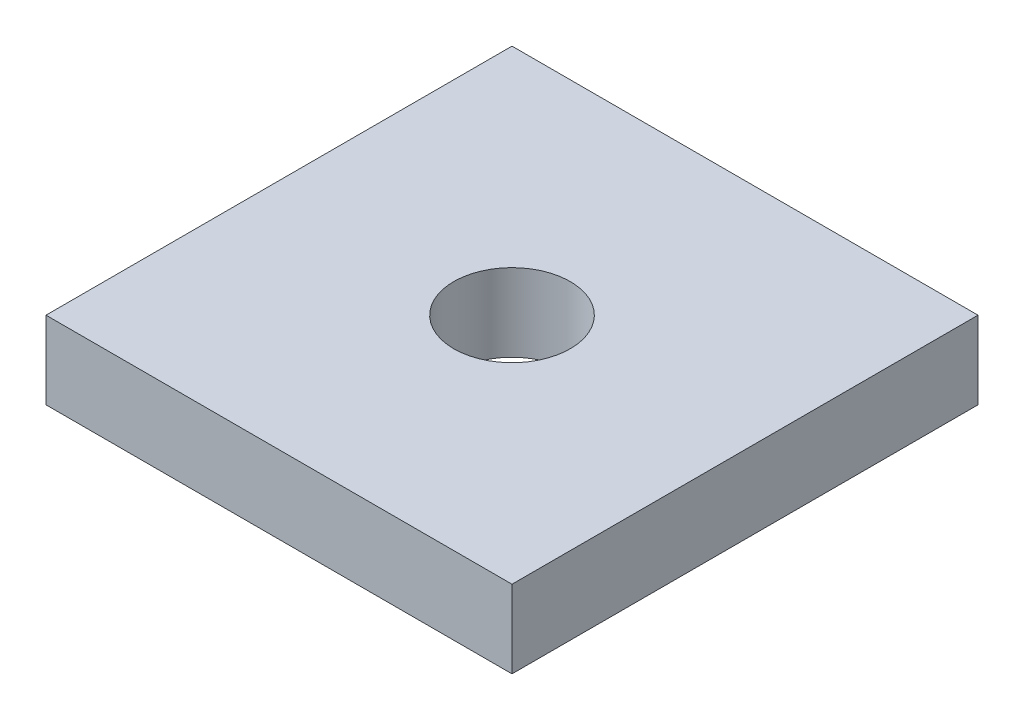
ISO-10303-21;
HEADER;
FILE_DESCRIPTION(('STEP AP214'),'2;1');
FILE_NAME('part.step','',(''),(''),'','','');
FILE_SCHEMA(('AUTOMOTIVE_DESIGN { 1 0 10303 214 1 1 1 1 }'));
ENDSEC;
DATA;
#1=APPLICATION_CONTEXT('core data for automotive mechanical design processes');
#2=APPLICATION_PROTOCOL_DEFINITION('international standard','automotive_design',2000,#1);
#3=PRODUCT_CONTEXT('',#1,'mechanical');
#4=PRODUCT('Part','Part','',(#3));
#5=PRODUCT_RELATED_PRODUCT_CATEGORY('part','',(#4));
#6=PRODUCT_DEFINITION_FORMATION('','',#4);
#7=PRODUCT_DEFINITION_CONTEXT('part definition',#1,'design');
#8=PRODUCT_DEFINITION('design','',#6,#7);
#9=PRODUCT_DEFINITION_SHAPE('','',#8);
#10=(LENGTH_UNIT() NAMED_UNIT(*) SI_UNIT(.MILLI.,.METRE.));
#11=(NAMED_UNIT(*) PLANE_ANGLE_UNIT() SI_UNIT($,.RADIAN.));
#12=(NAMED_UNIT(*) SI_UNIT($,.STERADIAN.) SOLID_ANGLE_UNIT());
#13=UNCERTAINTY_MEASURE_WITH_UNIT(LENGTH_MEASURE(1.E-05),#10,'distance_accuracy_value','');
#14=(GEOMETRIC_REPRESENTATION_CONTEXT(3) GLOBAL_UNCERTAINTY_ASSIGNED_CONTEXT((#13)) GLOBAL_UNIT_ASSIGNED_CONTEXT((#10,
#11,#12)) REPRESENTATION_CONTEXT('',''));
#15=CARTESIAN_POINT('',(0.,0.,0.));
#16=DIRECTION('',(0.,0.,1.));
#17=DIRECTION('',(1.,0.,0.));
#18=AXIS2_PLACEMENT_3D('',#15,#16,#17);
#19=CARTESIAN_POINT('',(0.,12.7,-76.2));
#20=DIRECTION('',(0.,-1.,0.));
#21=DIRECTION('',(0.,0.,-1.));
#22=AXIS2_PLACEMENT_3D('',#19,#20,#21);
#23=PLANE('',#22);
#24=DIRECTION('',(0.,0.,1.));
#25=VECTOR('',#24,1.);
#26=CARTESIAN_POINT('',(0.,12.7,0.));
#27=LINE('',#26,#25);
#28=CARTESIAN_POINT('',(0.,12.7,-76.2));
#29=VERTEX_POINT('',#28);
#30=CARTESIAN_POINT('',(0.,12.7,0.));
#31=VERTEX_POINT('',#30);
#32=EDGE_CURVE('E86',#29,#31,#27,.T.);
#33=ORIENTED_EDGE('',*,*,#32,.T.);
#34=DIRECTION('',(1.,0.,0.));
#35=VECTOR('',#34,1.);
#36=CARTESIAN_POINT('',(0.,12.7,0.));
#37=LINE('',#36,#35);
#38=CARTESIAN_POINT('',(76.2,12.7,0.));
#39=VERTEX_POINT('',#38);
#40=EDGE_CURVE('E81',#31,#39,#37,.T.);
#41=ORIENTED_EDGE('',*,*,#40,.T.);
#42=DIRECTION('',(0.,0.,-1.));
#43=VECTOR('',#42,1.);
#44=CARTESIAN_POINT('',(76.2,12.7,0.));
#45=LINE('',#44,#43);
#46=CARTESIAN_POINT('',(76.2,12.7,-76.2));
#47=VERTEX_POINT('',#46);
#48=EDGE_CURVE('E84',#39,#47,#45,.T.);
#49=ORIENTED_EDGE('',*,*,#48,.T.);
#50=DIRECTION('',(-1.,0.,0.));
#51=VECTOR('',#50,1.);
#52=CARTESIAN_POINT('',(0.,12.7,-76.2));
#53=LINE('',#52,#51);
#54=EDGE_CURVE('E51',#47,#29,#53,.T.);
#55=ORIENTED_EDGE('',*,*,#54,.T.);
#56=EDGE_LOOP('',(#33,#41,#49,#55));
#57=FACE_BOUND('',#56,.T.);
#58=CARTESIAN_POINT('',(38.1,12.7,-38.1));
#59=DIRECTION('',(0.,1.,0.));
#60=DIRECTION('',(0.,0.,1.));
#61=AXIS2_PLACEMENT_3D('',#58,#59,#60);
#62=CIRCLE('',#61,9.525);
#63=CARTESIAN_POINT('',(38.1,12.7,-28.575));
#64=VERTEX_POINT('',#63);
#65=EDGE_CURVE('E101',#64,#64,#62,.T.);
#66=ORIENTED_EDGE('',*,*,#65,.F.);
#67=EDGE_LOOP('',(#66));
#68=FACE_BOUND('',#67,.T.);
#69=ADVANCED_FACE('F34',(#57,#68),#23,.F.);
#70=CARTESIAN_POINT('',(0.,0.,-76.2));
#71=DIRECTION('',(0.,-1.,0.));
#72=DIRECTION('',(0.,0.,-1.));
#73=AXIS2_PLACEMENT_3D('',#70,#71,#72);
#74=PLANE('',#73);
#75=DIRECTION('',(0.,0.,1.));
#76=VECTOR('',#75,1.);
#77=CARTESIAN_POINT('',(0.,0.,0.));
#78=LINE('',#77,#76);
#79=CARTESIAN_POINT('',(0.,0.,-76.2));
#80=VERTEX_POINT('',#79);
#81=CARTESIAN_POINT('',(0.,0.,0.));
#82=VERTEX_POINT('',#81);
#83=EDGE_CURVE('E98',#80,#82,#78,.T.);
#84=ORIENTED_EDGE('',*,*,#83,.F.);
#85=DIRECTION('',(-1.,0.,0.));
#86=VECTOR('',#85,1.);
#87=CARTESIAN_POINT('',(0.,0.,-76.2));
#88=LINE('',#87,#86);
#89=CARTESIAN_POINT('',(76.2,0.,-76.2));
#90=VERTEX_POINT('',#89);
#91=EDGE_CURVE('E74',#90,#80,#88,.T.);
#92=ORIENTED_EDGE('',*,*,#91,.F.);
#93=DIRECTION('',(0.,0.,-1.));
#94=VECTOR('',#93,1.);
#95=CARTESIAN_POINT('',(76.2,0.,0.));
#96=LINE('',#95,#94);
#97=CARTESIAN_POINT('',(76.2,0.,0.));
#98=VERTEX_POINT('',#97);
#99=EDGE_CURVE('E68',#98,#90,#96,.T.);
#100=ORIENTED_EDGE('',*,*,#99,.F.);
#101=DIRECTION('',(1.,0.,0.));
#102=VECTOR('',#101,1.);
#103=CARTESIAN_POINT('',(0.,0.,0.));
#104=LINE('',#103,#102);
#105=EDGE_CURVE('E90',#82,#98,#104,.T.);
#106=ORIENTED_EDGE('',*,*,#105,.F.);
#107=EDGE_LOOP('',(#84,#92,#100,#106));
#108=FACE_BOUND('',#107,.T.);
#109=CARTESIAN_POINT('',(38.1,0.,-38.1));
#110=DIRECTION('',(0.,1.,0.));
#111=DIRECTION('',(0.,0.,1.));
#112=AXIS2_PLACEMENT_3D('',#109,#110,#111);
#113=CIRCLE('',#112,9.525);
#114=CARTESIAN_POINT('',(38.1,0.,-28.575));
#115=VERTEX_POINT('',#114);
#116=EDGE_CURVE('E113',#115,#115,#113,.T.);
#117=ORIENTED_EDGE('',*,*,#116,.T.);
#118=EDGE_LOOP('',(#117));
#119=FACE_BOUND('',#118,.T.);
#120=ADVANCED_FACE('F109',(#108,#119),#74,.T.);
#121=CARTESIAN_POINT('',(0.,12.7,0.));
#122=DIRECTION('',(1.,0.,0.));
#123=DIRECTION('',(0.,0.,-1.));
#124=AXIS2_PLACEMENT_3D('',#121,#122,#123);
#125=PLANE('',#124);
#126=ORIENTED_EDGE('',*,*,#83,.T.);
#127=DIRECTION('',(0.,-1.,0.));
#128=VECTOR('',#127,1.);
#129=CARTESIAN_POINT('',(0.,12.7,0.));
#130=LINE('',#129,#128);
#131=EDGE_CURVE('E11',#31,#82,#130,.T.);
#132=ORIENTED_EDGE('',*,*,#131,.F.);
#133=ORIENTED_EDGE('',*,*,#32,.F.);
#134=DIRECTION('',(0.,-1.,0.));
#135=VECTOR('',#134,1.);
#136=CARTESIAN_POINT('',(0.,12.7,-76.2));
#137=LINE('',#136,#135);
#138=EDGE_CURVE('E94',#29,#80,#137,.T.);
#139=ORIENTED_EDGE('',*,*,#138,.T.);
#140=EDGE_LOOP('',(#126,#132,#133,#139));
#141=FACE_BOUND('',#140,.T.);
#142=ADVANCED_FACE('F36',(#141),#125,.F.);
#143=CARTESIAN_POINT('',(0.,12.7,0.));
#144=DIRECTION('',(0.,0.,-1.));
#145=DIRECTION('',(-1.,0.,0.));
#146=AXIS2_PLACEMENT_3D('',#143,#144,#145);
#147=PLANE('',#146);
#148=ORIENTED_EDGE('',*,*,#105,.T.);
#149=DIRECTION('',(0.,-1.,0.));
#150=VECTOR('',#149,1.);
#151=CARTESIAN_POINT('',(76.2,12.7,0.));
#152=LINE('',#151,#150);
#153=EDGE_CURVE('E43',#39,#98,#152,.T.);
#154=ORIENTED_EDGE('',*,*,#153,.F.);
#155=ORIENTED_EDGE('',*,*,#40,.F.);
#156=ORIENTED_EDGE('',*,*,#131,.T.);
#157=EDGE_LOOP('',(#148,#154,#155,#156));
#158=FACE_BOUND('',#157,.T.);
#159=ADVANCED_FACE('F89',(#158),#147,.F.);
#160=CARTESIAN_POINT('',(76.2,12.7,0.));
#161=DIRECTION('',(-1.,0.,0.));
#162=DIRECTION('',(0.,0.,1.));
#163=AXIS2_PLACEMENT_3D('',#160,#161,#162);
#164=PLANE('',#163);
#165=ORIENTED_EDGE('',*,*,#99,.T.);
#166=DIRECTION('',(0.,-1.,0.));
#167=VECTOR('',#166,1.);
#168=CARTESIAN_POINT('',(76.2,12.7,-76.2));
#169=LINE('',#168,#167);
#170=EDGE_CURVE('E91',#47,#90,#169,.T.);
#171=ORIENTED_EDGE('',*,*,#170,.F.);
#172=ORIENTED_EDGE('',*,*,#48,.F.);
#173=ORIENTED_EDGE('',*,*,#153,.T.);
#174=EDGE_LOOP('',(#165,#171,#172,#173));
#175=FACE_BOUND('',#174,.T.);
#176=ADVANCED_FACE('F92',(#175),#164,.F.);
#177=CARTESIAN_POINT('',(0.,12.7,-76.2));
#178=DIRECTION('',(0.,0.,1.));
#179=DIRECTION('',(1.,0.,0.));
#180=AXIS2_PLACEMENT_3D('',#177,#178,#179);
#181=PLANE('',#180);
#182=ORIENTED_EDGE('',*,*,#91,.T.);
#183=ORIENTED_EDGE('',*,*,#138,.F.);
#184=ORIENTED_EDGE('',*,*,#54,.F.);
#185=ORIENTED_EDGE('',*,*,#170,.T.);
#186=EDGE_LOOP('',(#182,#183,#184,#185));
#187=FACE_BOUND('',#186,.T.);
#188=ADVANCED_FACE('F106',(#187),#181,.F.);
#189=CARTESIAN_POINT('',(38.1,12.7,-38.1));
#190=DIRECTION('',(0.,-1.,0.));
#191=DIRECTION('',(0.,0.,-1.));
#192=AXIS2_PLACEMENT_3D('',#189,#190,#191);
#193=CYLINDRICAL_SURFACE('',#192,9.525);
#194=ORIENTED_EDGE('',*,*,#65,.T.);
#195=EDGE_LOOP('',(#194));
#196=FACE_BOUND('',#195,.T.);
#197=ORIENTED_EDGE('',*,*,#116,.F.);
#198=EDGE_LOOP('',(#197));
#199=FACE_BOUND('',#198,.T.);
#200=ADVANCED_FACE('F119',(#196,#199),#193,.F.);
#201=CLOSED_SHELL('',(#69,#120,#142,#159,#176,#188,#200));
#202=MANIFOLD_SOLID_BREP('B2',#201);
#203=ADVANCED_BREP_SHAPE_REPRESENTATION('',(#18,#202),#14);
#204=SHAPE_DEFINITION_REPRESENTATION(#9,#203);
ENDSEC;
END-ISO-10303-21;
